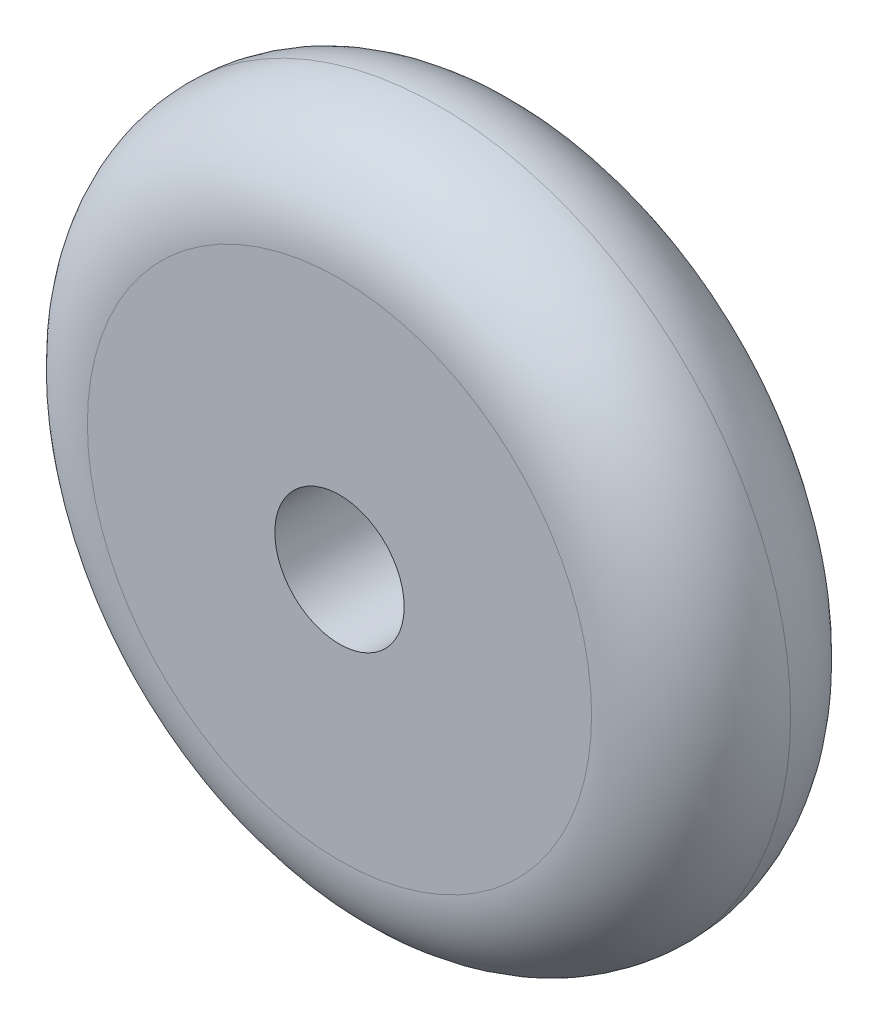
ISO-10303-21;
HEADER;
FILE_DESCRIPTION(('STEP AP214'),'2;1');
FILE_NAME('part.step','',(''),(''),'','','');
FILE_SCHEMA(('AUTOMOTIVE_DESIGN { 1 0 10303 214 1 1 1 1 }'));
ENDSEC;
DATA;
#1=APPLICATION_CONTEXT('core data for automotive mechanical design processes');
#2=APPLICATION_PROTOCOL_DEFINITION('international standard','automotive_design',2000,#1);
#3=PRODUCT_CONTEXT('',#1,'mechanical');
#4=PRODUCT('Part','Part','',(#3));
#5=PRODUCT_RELATED_PRODUCT_CATEGORY('part','',(#4));
#6=PRODUCT_DEFINITION_FORMATION('','',#4);
#7=PRODUCT_DEFINITION_CONTEXT('part definition',#1,'design');
#8=PRODUCT_DEFINITION('design','',#6,#7);
#9=PRODUCT_DEFINITION_SHAPE('','',#8);
#10=(LENGTH_UNIT() NAMED_UNIT(*) SI_UNIT(.MILLI.,.METRE.));
#11=(NAMED_UNIT(*) PLANE_ANGLE_UNIT() SI_UNIT($,.RADIAN.));
#12=(NAMED_UNIT(*) SI_UNIT($,.STERADIAN.) SOLID_ANGLE_UNIT());
#13=UNCERTAINTY_MEASURE_WITH_UNIT(LENGTH_MEASURE(1.E-05),#10,'distance_accuracy_value','');
#14=(GEOMETRIC_REPRESENTATION_CONTEXT(3) GLOBAL_UNCERTAINTY_ASSIGNED_CONTEXT((#13)) GLOBAL_UNIT_ASSIGNED_CONTEXT((#10,
#11,#12)) REPRESENTATION_CONTEXT('',''));
#15=CARTESIAN_POINT('',(0.,0.,0.));
#16=DIRECTION('',(0.,0.,1.));
#17=DIRECTION('',(1.,0.,0.));
#18=AXIS2_PLACEMENT_3D('',#15,#16,#17);
#19=CARTESIAN_POINT('',(0.,0.,12.));
#20=DIRECTION('',(0.,0.,1.));
#21=DIRECTION('',(1.,0.,0.));
#22=AXIS2_PLACEMENT_3D('',#19,#20,#21);
#23=PLANE('',#22);
#24=CARTESIAN_POINT('',(0.,0.,12.));
#25=DIRECTION('',(0.,0.,1.));
#26=DIRECTION('',(1.,0.,0.));
#27=AXIS2_PLACEMENT_3D('',#24,#25,#26);
#28=CIRCLE('',#27,15.2);
#29=CARTESIAN_POINT('',(15.2,0.,12.));
#30=VERTEX_POINT('',#29);
#31=EDGE_CURVE('E48',#30,#30,#28,.T.);
#32=ORIENTED_EDGE('',*,*,#31,.T.);
#33=EDGE_LOOP('',(#32));
#34=FACE_BOUND('',#33,.T.);
#35=CARTESIAN_POINT('',(0.,0.,12.));
#36=DIRECTION('',(0.,0.,1.));
#37=DIRECTION('',(1.,0.,0.));
#38=AXIS2_PLACEMENT_3D('',#35,#36,#37);
#39=CIRCLE('',#38,3.9);
#40=CARTESIAN_POINT('',(3.9,0.,12.));
#41=VERTEX_POINT('',#40);
#42=EDGE_CURVE('E52',#41,#41,#39,.T.);
#43=ORIENTED_EDGE('',*,*,#42,.F.);
#44=EDGE_LOOP('',(#43));
#45=FACE_BOUND('',#44,.T.);
#46=ADVANCED_FACE('F37',(#34,#45),#23,.T.);
#47=CARTESIAN_POINT('',(0.,0.,0.));
#48=DIRECTION('',(0.,0.,1.));
#49=DIRECTION('',(1.,0.,0.));
#50=AXIS2_PLACEMENT_3D('',#47,#48,#49);
#51=PLANE('',#50);
#52=CARTESIAN_POINT('',(0.,0.,0.));
#53=DIRECTION('',(0.,0.,1.));
#54=DIRECTION('',(1.,0.,0.));
#55=AXIS2_PLACEMENT_3D('',#52,#53,#54);
#56=CIRCLE('',#55,15.2);
#57=CARTESIAN_POINT('',(15.2,0.,0.));
#58=VERTEX_POINT('',#57);
#59=EDGE_CURVE('E11',#58,#58,#56,.F.);
#60=ORIENTED_EDGE('',*,*,#59,.T.);
#61=EDGE_LOOP('',(#60));
#62=FACE_BOUND('',#61,.T.);
#63=CARTESIAN_POINT('',(0.,0.,0.));
#64=DIRECTION('',(0.,0.,1.));
#65=DIRECTION('',(1.,0.,0.));
#66=AXIS2_PLACEMENT_3D('',#63,#64,#65);
#67=CIRCLE('',#66,3.9);
#68=CARTESIAN_POINT('',(3.9,0.,0.));
#69=VERTEX_POINT('',#68);
#70=EDGE_CURVE('E55',#69,#69,#67,.T.);
#71=ORIENTED_EDGE('',*,*,#70,.T.);
#72=EDGE_LOOP('',(#71));
#73=FACE_BOUND('',#72,.T.);
#74=ADVANCED_FACE('F65',(#62,#73),#51,.F.);
#75=CARTESIAN_POINT('',(0.,0.,12.));
#76=DIRECTION('',(0.,0.,-1.));
#77=DIRECTION('',(-1.,0.,0.));
#78=AXIS2_PLACEMENT_3D('',#75,#76,#77);
#79=CYLINDRICAL_SURFACE('',#78,3.9);
#80=ORIENTED_EDGE('',*,*,#42,.T.);
#81=EDGE_LOOP('',(#80));
#82=FACE_BOUND('',#81,.T.);
#83=ORIENTED_EDGE('',*,*,#70,.F.);
#84=EDGE_LOOP('',(#83));
#85=FACE_BOUND('',#84,.T.);
#86=ADVANCED_FACE('F61',(#82,#85),#79,.F.);
#87=CARTESIAN_POINT('',(0.,0.,6.));
#88=DIRECTION('',(0.,0.,1.));
#89=DIRECTION('',(1.,0.,0.));
#90=AXIS2_PLACEMENT_3D('',#87,#88,#89);
#91=TOROIDAL_SURFACE('',#90,15.2,6.);
#92=CARTESIAN_POINT('',(0.,0.,6.));
#93=DIRECTION('',(0.,0.,1.));
#94=DIRECTION('',(1.,0.,0.));
#95=AXIS2_PLACEMENT_3D('',#92,#93,#94);
#96=CIRCLE('',#95,21.2);
#97=CARTESIAN_POINT('',(21.2,0.,6.));
#98=VERTEX_POINT('',#97);
#99=EDGE_CURVE('E44',#98,#98,#96,.F.);
#100=ORIENTED_EDGE('',*,*,#99,.F.);
#101=EDGE_LOOP('',(#100));
#102=FACE_BOUND('',#101,.T.);
#103=ORIENTED_EDGE('',*,*,#31,.F.);
#104=EDGE_LOOP('',(#103));
#105=FACE_BOUND('',#104,.T.);
#106=ADVANCED_FACE('F73',(#102,#105),#91,.T.);
#107=CARTESIAN_POINT('',(0.,0.,6.));
#108=DIRECTION('',(0.,0.,1.));
#109=DIRECTION('',(1.,0.,0.));
#110=AXIS2_PLACEMENT_3D('',#107,#108,#109);
#111=TOROIDAL_SURFACE('',#110,15.2,6.);
#112=ORIENTED_EDGE('',*,*,#59,.F.);
#113=EDGE_LOOP('',(#112));
#114=FACE_BOUND('',#113,.T.);
#115=ORIENTED_EDGE('',*,*,#99,.T.);
#116=EDGE_LOOP('',(#115));
#117=FACE_BOUND('',#116,.T.);
#118=ADVANCED_FACE('F39',(#114,#117),#111,.T.);
#119=CLOSED_SHELL('',(#46,#74,#86,#106,#118));
#120=MANIFOLD_SOLID_BREP('B2',#119);
#121=ADVANCED_BREP_SHAPE_REPRESENTATION('',(#18,#120),#14);
#122=SHAPE_DEFINITION_REPRESENTATION(#9,#121);
ENDSEC;
END-ISO-10303-21;
